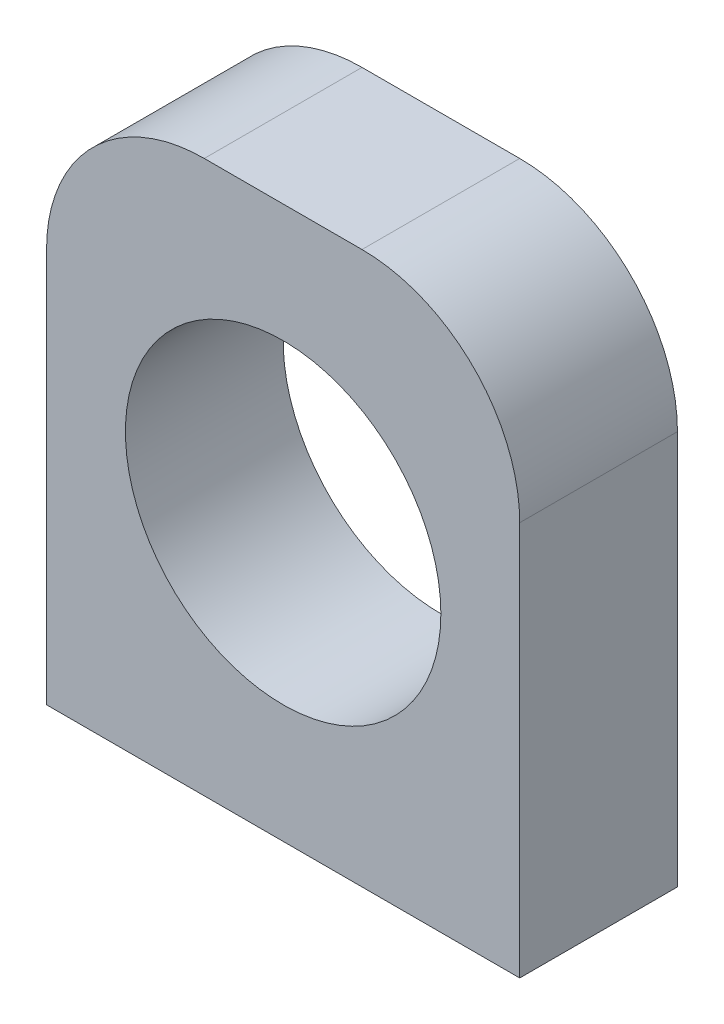
ISO-10303-21;
HEADER;
FILE_DESCRIPTION(('STEP AP214'),'2;1');
FILE_NAME('part.step','',(''),(''),'','','');
FILE_SCHEMA(('AUTOMOTIVE_DESIGN { 1 0 10303 214 1 1 1 1 }'));
ENDSEC;
DATA;
#1=APPLICATION_CONTEXT('core data for automotive mechanical design processes');
#2=APPLICATION_PROTOCOL_DEFINITION('international standard','automotive_design',2000,#1);
#3=PRODUCT_CONTEXT('',#1,'mechanical');
#4=PRODUCT('Part','Part','',(#3));
#5=PRODUCT_RELATED_PRODUCT_CATEGORY('part','',(#4));
#6=PRODUCT_DEFINITION_FORMATION('','',#4);
#7=PRODUCT_DEFINITION_CONTEXT('part definition',#1,'design');
#8=PRODUCT_DEFINITION('design','',#6,#7);
#9=PRODUCT_DEFINITION_SHAPE('','',#8);
#10=(LENGTH_UNIT() NAMED_UNIT(*) SI_UNIT(.MILLI.,.METRE.));
#11=(NAMED_UNIT(*) PLANE_ANGLE_UNIT() SI_UNIT($,.RADIAN.));
#12=(NAMED_UNIT(*) SI_UNIT($,.STERADIAN.) SOLID_ANGLE_UNIT());
#13=UNCERTAINTY_MEASURE_WITH_UNIT(LENGTH_MEASURE(1.E-05),#10,'distance_accuracy_value','');
#14=(GEOMETRIC_REPRESENTATION_CONTEXT(3) GLOBAL_UNCERTAINTY_ASSIGNED_CONTEXT((#13)) GLOBAL_UNIT_ASSIGNED_CONTEXT((#10,
#11,#12)) REPRESENTATION_CONTEXT('',''));
#15=CARTESIAN_POINT('',(0.,0.,0.));
#16=DIRECTION('',(0.,0.,1.));
#17=DIRECTION('',(1.,0.,0.));
#18=AXIS2_PLACEMENT_3D('',#15,#16,#17);
#19=CARTESIAN_POINT('',(12.7,19.05,12.7));
#20=DIRECTION('',(0.,0.,1.));
#21=DIRECTION('',(1.,0.,0.));
#22=AXIS2_PLACEMENT_3D('',#19,#20,#21);
#23=PLANE('',#22);
#24=DIRECTION('',(0.,1.,0.));
#25=VECTOR('',#24,1.);
#26=CARTESIAN_POINT('',(38.1,-44.45,12.7));
#27=LINE('',#26,#25);
#28=CARTESIAN_POINT('',(38.1,-44.45,12.7));
#29=VERTEX_POINT('',#28);
#30=CARTESIAN_POINT('',(38.1,19.05,12.7));
#31=VERTEX_POINT('',#30);
#32=EDGE_CURVE('E139',#29,#31,#27,.T.);
#33=ORIENTED_EDGE('',*,*,#32,.T.);
#34=CARTESIAN_POINT('',(12.7,19.05,12.7));
#35=DIRECTION('',(0.,0.,1.));
#36=DIRECTION('',(1.,0.,0.));
#37=AXIS2_PLACEMENT_3D('',#34,#35,#36);
#38=CIRCLE('',#37,25.4);
#39=CARTESIAN_POINT('',(12.7,44.45,12.7));
#40=VERTEX_POINT('',#39);
#41=EDGE_CURVE('E95',#31,#40,#38,.T.);
#42=ORIENTED_EDGE('',*,*,#41,.T.);
#43=DIRECTION('',(-1.,0.,0.));
#44=VECTOR('',#43,1.);
#45=CARTESIAN_POINT('',(12.7,44.45,12.7));
#46=LINE('',#45,#44);
#47=CARTESIAN_POINT('',(-12.7,44.45,12.7));
#48=VERTEX_POINT('',#47);
#49=EDGE_CURVE('E110',#40,#48,#46,.T.);
#50=ORIENTED_EDGE('',*,*,#49,.T.);
#51=CARTESIAN_POINT('',(-12.7,19.05,12.7));
#52=DIRECTION('',(0.,0.,1.));
#53=DIRECTION('',(1.,0.,0.));
#54=AXIS2_PLACEMENT_3D('',#51,#52,#53);
#55=CIRCLE('',#54,25.4);
#56=CARTESIAN_POINT('',(-38.1,19.05,12.7));
#57=VERTEX_POINT('',#56);
#58=EDGE_CURVE('E104',#48,#57,#55,.T.);
#59=ORIENTED_EDGE('',*,*,#58,.T.);
#60=DIRECTION('',(0.,-1.,0.));
#61=VECTOR('',#60,1.);
#62=CARTESIAN_POINT('',(-38.1,-44.45,12.7));
#63=LINE('',#62,#61);
#64=CARTESIAN_POINT('',(-38.1,-44.45,12.7));
#65=VERTEX_POINT('',#64);
#66=EDGE_CURVE('E108',#57,#65,#63,.T.);
#67=ORIENTED_EDGE('',*,*,#66,.T.);
#68=DIRECTION('',(1.,0.,0.));
#69=VECTOR('',#68,1.);
#70=CARTESIAN_POINT('',(38.1,-44.45,12.7));
#71=LINE('',#70,#69);
#72=EDGE_CURVE('E57',#65,#29,#71,.T.);
#73=ORIENTED_EDGE('',*,*,#72,.T.);
#74=EDGE_LOOP('',(#33,#42,#50,#59,#67,#73));
#75=FACE_BOUND('',#74,.T.);
#76=CARTESIAN_POINT('',(0.,0.,12.7));
#77=DIRECTION('',(0.,0.,1.));
#78=DIRECTION('',(1.,0.,0.));
#79=AXIS2_PLACEMENT_3D('',#76,#77,#78);
#80=CIRCLE('',#79,25.4);
#81=CARTESIAN_POINT('',(25.4,0.,12.7));
#82=VERTEX_POINT('',#81);
#83=EDGE_CURVE('E132',#82,#82,#80,.T.);
#84=ORIENTED_EDGE('',*,*,#83,.F.);
#85=EDGE_LOOP('',(#84));
#86=FACE_BOUND('',#85,.T.);
#87=ADVANCED_FACE('F40',(#75,#86),#23,.T.);
#88=CARTESIAN_POINT('',(12.7,19.05,-12.7));
#89=DIRECTION('',(0.,0.,1.));
#90=DIRECTION('',(1.,0.,0.));
#91=AXIS2_PLACEMENT_3D('',#88,#89,#90);
#92=PLANE('',#91);
#93=DIRECTION('',(0.,1.,0.));
#94=VECTOR('',#93,1.);
#95=CARTESIAN_POINT('',(38.1,-44.45,-12.7));
#96=LINE('',#95,#94);
#97=CARTESIAN_POINT('',(38.1,-44.45,-12.7));
#98=VERTEX_POINT('',#97);
#99=CARTESIAN_POINT('',(38.1,19.05,-12.7));
#100=VERTEX_POINT('',#99);
#101=EDGE_CURVE('E128',#98,#100,#96,.T.);
#102=ORIENTED_EDGE('',*,*,#101,.F.);
#103=DIRECTION('',(1.,0.,0.));
#104=VECTOR('',#103,1.);
#105=CARTESIAN_POINT('',(38.1,-44.45,-12.7));
#106=LINE('',#105,#104);
#107=CARTESIAN_POINT('',(-38.1,-44.45,-12.7));
#108=VERTEX_POINT('',#107);
#109=EDGE_CURVE('E87',#108,#98,#106,.T.);
#110=ORIENTED_EDGE('',*,*,#109,.F.);
#111=DIRECTION('',(0.,-1.,0.));
#112=VECTOR('',#111,1.);
#113=CARTESIAN_POINT('',(-38.1,-44.45,-12.7));
#114=LINE('',#113,#112);
#115=CARTESIAN_POINT('',(-38.1,19.05,-12.7));
#116=VERTEX_POINT('',#115);
#117=EDGE_CURVE('E81',#116,#108,#114,.T.);
#118=ORIENTED_EDGE('',*,*,#117,.F.);
#119=CARTESIAN_POINT('',(-12.7,19.05,-12.7));
#120=DIRECTION('',(0.,0.,1.));
#121=DIRECTION('',(1.,0.,0.));
#122=AXIS2_PLACEMENT_3D('',#119,#120,#121);
#123=CIRCLE('',#122,25.4);
#124=CARTESIAN_POINT('',(-12.7,44.45,-12.7));
#125=VERTEX_POINT('',#124);
#126=EDGE_CURVE('E118',#125,#116,#123,.T.);
#127=ORIENTED_EDGE('',*,*,#126,.F.);
#128=DIRECTION('',(-1.,0.,0.));
#129=VECTOR('',#128,1.);
#130=CARTESIAN_POINT('',(12.7,44.45,-12.7));
#131=LINE('',#130,#129);
#132=CARTESIAN_POINT('',(12.7,44.45,-12.7));
#133=VERTEX_POINT('',#132);
#134=EDGE_CURVE('E134',#133,#125,#131,.T.);
#135=ORIENTED_EDGE('',*,*,#134,.F.);
#136=CARTESIAN_POINT('',(12.7,19.05,-12.7));
#137=DIRECTION('',(0.,0.,1.));
#138=DIRECTION('',(1.,0.,0.));
#139=AXIS2_PLACEMENT_3D('',#136,#137,#138);
#140=CIRCLE('',#139,25.4);
#141=EDGE_CURVE('E131',#100,#133,#140,.T.);
#142=ORIENTED_EDGE('',*,*,#141,.F.);
#143=EDGE_LOOP('',(#102,#110,#118,#127,#135,#142));
#144=FACE_BOUND('',#143,.T.);
#145=CARTESIAN_POINT('',(0.,0.,-12.7));
#146=DIRECTION('',(0.,0.,1.));
#147=DIRECTION('',(1.,0.,0.));
#148=AXIS2_PLACEMENT_3D('',#145,#146,#147);
#149=CIRCLE('',#148,25.4);
#150=CARTESIAN_POINT('',(25.4,0.,-12.7));
#151=VERTEX_POINT('',#150);
#152=EDGE_CURVE('E234',#151,#151,#149,.T.);
#153=ORIENTED_EDGE('',*,*,#152,.T.);
#154=EDGE_LOOP('',(#153));
#155=FACE_BOUND('',#154,.T.);
#156=ADVANCED_FACE('F148',(#144,#155),#92,.F.);
#157=CARTESIAN_POINT('',(38.1,-44.45,12.7));
#158=DIRECTION('',(-1.,0.,0.));
#159=DIRECTION('',(0.,0.,1.));
#160=AXIS2_PLACEMENT_3D('',#157,#158,#159);
#161=PLANE('',#160);
#162=ORIENTED_EDGE('',*,*,#101,.T.);
#163=DIRECTION('',(0.,0.,-1.));
#164=VECTOR('',#163,1.);
#165=CARTESIAN_POINT('',(38.1,19.05,12.7));
#166=LINE('',#165,#164);
#167=EDGE_CURVE('E11',#31,#100,#166,.T.);
#168=ORIENTED_EDGE('',*,*,#167,.F.);
#169=ORIENTED_EDGE('',*,*,#32,.F.);
#170=DIRECTION('',(0.,0.,-1.));
#171=VECTOR('',#170,1.);
#172=CARTESIAN_POINT('',(38.1,-44.45,12.7));
#173=LINE('',#172,#171);
#174=EDGE_CURVE('E124',#29,#98,#173,.T.);
#175=ORIENTED_EDGE('',*,*,#174,.T.);
#176=EDGE_LOOP('',(#162,#168,#169,#175));
#177=FACE_BOUND('',#176,.T.);
#178=ADVANCED_FACE('F42',(#177),#161,.F.);
#179=CARTESIAN_POINT('',(12.7,19.05,12.7));
#180=DIRECTION('',(0.,0.,-1.));
#181=DIRECTION('',(-1.,0.,0.));
#182=AXIS2_PLACEMENT_3D('',#179,#180,#181);
#183=CYLINDRICAL_SURFACE('',#182,25.4);
#184=ORIENTED_EDGE('',*,*,#141,.T.);
#185=DIRECTION('',(0.,0.,-1.));
#186=VECTOR('',#185,1.);
#187=CARTESIAN_POINT('',(12.7,44.45,12.7));
#188=LINE('',#187,#186);
#189=EDGE_CURVE('E49',#40,#133,#188,.T.);
#190=ORIENTED_EDGE('',*,*,#189,.F.);
#191=ORIENTED_EDGE('',*,*,#41,.F.);
#192=ORIENTED_EDGE('',*,*,#167,.T.);
#193=EDGE_LOOP('',(#184,#190,#191,#192));
#194=FACE_BOUND('',#193,.T.);
#195=ADVANCED_FACE('F320',(#194),#183,.T.);
#196=CARTESIAN_POINT('',(12.7,44.45,12.7));
#197=DIRECTION('',(0.,-1.,0.));
#198=DIRECTION('',(0.,0.,-1.));
#199=AXIS2_PLACEMENT_3D('',#196,#197,#198);
#200=PLANE('',#199);
#201=ORIENTED_EDGE('',*,*,#134,.T.);
#202=DIRECTION('',(0.,0.,-1.));
#203=VECTOR('',#202,1.);
#204=CARTESIAN_POINT('',(-12.7,44.45,12.7));
#205=LINE('',#204,#203);
#206=EDGE_CURVE('E119',#48,#125,#205,.T.);
#207=ORIENTED_EDGE('',*,*,#206,.F.);
#208=ORIENTED_EDGE('',*,*,#49,.F.);
#209=ORIENTED_EDGE('',*,*,#189,.T.);
#210=EDGE_LOOP('',(#201,#207,#208,#209));
#211=FACE_BOUND('',#210,.T.);
#212=ADVANCED_FACE('F145',(#211),#200,.F.);
#213=CARTESIAN_POINT('',(-12.7,19.05,12.7));
#214=DIRECTION('',(0.,0.,-1.));
#215=DIRECTION('',(-1.,0.,0.));
#216=AXIS2_PLACEMENT_3D('',#213,#214,#215);
#217=CYLINDRICAL_SURFACE('',#216,25.4);
#218=ORIENTED_EDGE('',*,*,#126,.T.);
#219=DIRECTION('',(0.,0.,-1.));
#220=VECTOR('',#219,1.);
#221=CARTESIAN_POINT('',(-38.1,19.05,12.7));
#222=LINE('',#221,#220);
#223=EDGE_CURVE('E115',#57,#116,#222,.T.);
#224=ORIENTED_EDGE('',*,*,#223,.F.);
#225=ORIENTED_EDGE('',*,*,#58,.F.);
#226=ORIENTED_EDGE('',*,*,#206,.T.);
#227=EDGE_LOOP('',(#218,#224,#225,#226));
#228=FACE_BOUND('',#227,.T.);
#229=ADVANCED_FACE('F116',(#228),#217,.T.);
#230=CARTESIAN_POINT('',(-38.1,-44.45,12.7));
#231=DIRECTION('',(1.,0.,0.));
#232=DIRECTION('',(0.,0.,-1.));
#233=AXIS2_PLACEMENT_3D('',#230,#231,#232);
#234=PLANE('',#233);
#235=ORIENTED_EDGE('',*,*,#117,.T.);
#236=DIRECTION('',(0.,0.,-1.));
#237=VECTOR('',#236,1.);
#238=CARTESIAN_POINT('',(-38.1,-44.45,12.7));
#239=LINE('',#238,#237);
#240=EDGE_CURVE('E120',#65,#108,#239,.T.);
#241=ORIENTED_EDGE('',*,*,#240,.F.);
#242=ORIENTED_EDGE('',*,*,#66,.F.);
#243=ORIENTED_EDGE('',*,*,#223,.T.);
#244=EDGE_LOOP('',(#235,#241,#242,#243));
#245=FACE_BOUND('',#244,.T.);
#246=ADVANCED_FACE('F122',(#245),#234,.F.);
#247=CARTESIAN_POINT('',(38.1,-44.45,12.7));
#248=DIRECTION('',(0.,1.,0.));
#249=DIRECTION('',(-1.,0.,0.));
#250=AXIS2_PLACEMENT_3D('',#247,#248,#249);
#251=PLANE('',#250);
#252=CARTESIAN_POINT('',(-19.05,-44.45,7.9375));
#253=DIRECTION('',(0.,-1.,0.));
#254=DIRECTION('',(0.,0.,-1.));
#255=AXIS2_PLACEMENT_3D('',#252,#253,#254);
#256=CIRCLE('',#255,2.0193);
#257=CARTESIAN_POINT('',(-19.05,-44.45,5.9182));
#258=VERTEX_POINT('',#257);
#259=EDGE_CURVE('E212',#258,#258,#256,.T.);
#260=ORIENTED_EDGE('',*,*,#259,.F.);
#261=EDGE_LOOP('',(#260));
#262=FACE_BOUND('',#261,.T.);
#263=CARTESIAN_POINT('',(19.05,-44.45,7.9375));
#264=DIRECTION('',(0.,-1.,0.));
#265=DIRECTION('',(0.,0.,-1.));
#266=AXIS2_PLACEMENT_3D('',#263,#264,#265);
#267=CIRCLE('',#266,2.0193);
#268=CARTESIAN_POINT('',(19.05,-44.45,5.9182));
#269=VERTEX_POINT('',#268);
#270=EDGE_CURVE('E214',#269,#269,#267,.T.);
#271=ORIENTED_EDGE('',*,*,#270,.F.);
#272=EDGE_LOOP('',(#271));
#273=FACE_BOUND('',#272,.T.);
#274=CARTESIAN_POINT('',(19.05,-44.45,-7.9375));
#275=DIRECTION('',(0.,-1.,0.));
#276=DIRECTION('',(0.,0.,-1.));
#277=AXIS2_PLACEMENT_3D('',#274,#275,#276);
#278=CIRCLE('',#277,2.0193);
#279=CARTESIAN_POINT('',(19.05,-44.45,-9.9568));
#280=VERTEX_POINT('',#279);
#281=EDGE_CURVE('E222',#280,#280,#278,.T.);
#282=ORIENTED_EDGE('',*,*,#281,.F.);
#283=EDGE_LOOP('',(#282));
#284=FACE_BOUND('',#283,.T.);
#285=CARTESIAN_POINT('',(-19.05,-44.45,-7.9375));
#286=DIRECTION('',(0.,-1.,0.));
#287=DIRECTION('',(0.,0.,-1.));
#288=AXIS2_PLACEMENT_3D('',#285,#286,#287);
#289=CIRCLE('',#288,2.0193);
#290=CARTESIAN_POINT('',(-19.05,-44.45,-9.9568));
#291=VERTEX_POINT('',#290);
#292=EDGE_CURVE('E228',#291,#291,#289,.T.);
#293=ORIENTED_EDGE('',*,*,#292,.F.);
#294=EDGE_LOOP('',(#293));
#295=FACE_BOUND('',#294,.T.);
#296=ORIENTED_EDGE('',*,*,#109,.T.);
#297=ORIENTED_EDGE('',*,*,#174,.F.);
#298=ORIENTED_EDGE('',*,*,#72,.F.);
#299=ORIENTED_EDGE('',*,*,#240,.T.);
#300=EDGE_LOOP('',(#296,#297,#298,#299));
#301=FACE_BOUND('',#300,.T.);
#302=ADVANCED_FACE('F153',(#262,#273,#284,#295,#301),#251,.F.);
#303=CARTESIAN_POINT('',(0.,0.,12.7));
#304=DIRECTION('',(0.,0.,-1.));
#305=DIRECTION('',(-1.,0.,0.));
#306=AXIS2_PLACEMENT_3D('',#303,#304,#305);
#307=CYLINDRICAL_SURFACE('',#306,25.4);
#308=ORIENTED_EDGE('',*,*,#83,.T.);
#309=EDGE_LOOP('',(#308));
#310=FACE_BOUND('',#309,.T.);
#311=ORIENTED_EDGE('',*,*,#152,.F.);
#312=EDGE_LOOP('',(#311));
#313=FACE_BOUND('',#312,.T.);
#314=ADVANCED_FACE('F155',(#310,#313),#307,.F.);
#315=CARTESIAN_POINT('',(-19.05,-32.42056,-7.9375));
#316=DIRECTION('',(0.,-1.,0.));
#317=DIRECTION('',(0.,0.,-1.));
#318=AXIS2_PLACEMENT_3D('',#315,#316,#317);
#319=CONICAL_SURFACE('',#318,2.0193,1.02974425867665);
#320=CARTESIAN_POINT('',(-19.05,-31.2072421519976,-7.9375));
#321=VERTEX_POINT('',#320);
#322=VERTEX_LOOP('',#321);
#323=FACE_BOUND('',#322,.T.);
#324=CARTESIAN_POINT('',(-19.05,-32.42056,-7.9375));
#325=DIRECTION('',(0.,-1.,0.));
#326=DIRECTION('',(0.,0.,-1.));
#327=AXIS2_PLACEMENT_3D('',#324,#325,#326);
#328=CIRCLE('',#327,2.0193);
#329=CARTESIAN_POINT('',(-19.05,-32.42056,-9.9568));
#330=VERTEX_POINT('',#329);
#331=EDGE_CURVE('E231',#330,#330,#328,.T.);
#332=ORIENTED_EDGE('',*,*,#331,.T.);
#333=EDGE_LOOP('',(#332));
#334=FACE_BOUND('',#333,.T.);
#335=ADVANCED_FACE('F162',(#323,#334),#319,.F.);
#336=CARTESIAN_POINT('',(-19.05,-44.45,-7.9375));
#337=DIRECTION('',(0.,-1.,0.));
#338=DIRECTION('',(0.,0.,-1.));
#339=AXIS2_PLACEMENT_3D('',#336,#337,#338);
#340=CYLINDRICAL_SURFACE('',#339,2.0193);
#341=ORIENTED_EDGE('',*,*,#331,.F.);
#342=EDGE_LOOP('',(#341));
#343=FACE_BOUND('',#342,.T.);
#344=ORIENTED_EDGE('',*,*,#292,.T.);
#345=EDGE_LOOP('',(#344));
#346=FACE_BOUND('',#345,.T.);
#347=ADVANCED_FACE('F177',(#343,#346),#340,.F.);
#348=CARTESIAN_POINT('',(19.05,-32.42056,-7.9375));
#349=DIRECTION('',(0.,-1.,0.));
#350=DIRECTION('',(0.,0.,-1.));
#351=AXIS2_PLACEMENT_3D('',#348,#349,#350);
#352=CONICAL_SURFACE('',#351,2.0193,1.02974425867665);
#353=CARTESIAN_POINT('',(19.05,-31.2072421519976,-7.9375));
#354=VERTEX_POINT('',#353);
#355=VERTEX_LOOP('',#354);
#356=FACE_BOUND('',#355,.T.);
#357=CARTESIAN_POINT('',(19.05,-32.42056,-7.9375));
#358=DIRECTION('',(0.,-1.,0.));
#359=DIRECTION('',(0.,0.,-1.));
#360=AXIS2_PLACEMENT_3D('',#357,#358,#359);
#361=CIRCLE('',#360,2.0193);
#362=CARTESIAN_POINT('',(19.05,-32.42056,-9.9568));
#363=VERTEX_POINT('',#362);
#364=EDGE_CURVE('E225',#363,#363,#361,.T.);
#365=ORIENTED_EDGE('',*,*,#364,.T.);
#366=EDGE_LOOP('',(#365));
#367=FACE_BOUND('',#366,.T.);
#368=ADVANCED_FACE('F181',(#356,#367),#352,.F.);
#369=CARTESIAN_POINT('',(19.05,-44.45,-7.9375));
#370=DIRECTION('',(0.,-1.,0.));
#371=DIRECTION('',(0.,0.,-1.));
#372=AXIS2_PLACEMENT_3D('',#369,#370,#371);
#373=CYLINDRICAL_SURFACE('',#372,2.0193);
#374=ORIENTED_EDGE('',*,*,#364,.F.);
#375=EDGE_LOOP('',(#374));
#376=FACE_BOUND('',#375,.T.);
#377=ORIENTED_EDGE('',*,*,#281,.T.);
#378=EDGE_LOOP('',(#377));
#379=FACE_BOUND('',#378,.T.);
#380=ADVANCED_FACE('F185',(#376,#379),#373,.F.);
#381=CARTESIAN_POINT('',(19.05,-32.42056,7.9375));
#382=DIRECTION('',(0.,-1.,0.));
#383=DIRECTION('',(0.,0.,-1.));
#384=AXIS2_PLACEMENT_3D('',#381,#382,#383);
#385=CONICAL_SURFACE('',#384,2.0193,1.02974425867665);
#386=CARTESIAN_POINT('',(19.05,-31.2072421519976,7.9375));
#387=VERTEX_POINT('',#386);
#388=VERTEX_LOOP('',#387);
#389=FACE_BOUND('',#388,.T.);
#390=CARTESIAN_POINT('',(19.05,-32.42056,7.9375));
#391=DIRECTION('',(0.,-1.,0.));
#392=DIRECTION('',(0.,0.,-1.));
#393=AXIS2_PLACEMENT_3D('',#390,#391,#392);
#394=CIRCLE('',#393,2.0193);
#395=CARTESIAN_POINT('',(19.05,-32.42056,5.9182));
#396=VERTEX_POINT('',#395);
#397=EDGE_CURVE('E219',#396,#396,#394,.T.);
#398=ORIENTED_EDGE('',*,*,#397,.T.);
#399=EDGE_LOOP('',(#398));
#400=FACE_BOUND('',#399,.T.);
#401=ADVANCED_FACE('F189',(#389,#400),#385,.F.);
#402=CARTESIAN_POINT('',(19.05,-44.45,7.9375));
#403=DIRECTION('',(0.,-1.,0.));
#404=DIRECTION('',(0.,0.,-1.));
#405=AXIS2_PLACEMENT_3D('',#402,#403,#404);
#406=CYLINDRICAL_SURFACE('',#405,2.0193);
#407=ORIENTED_EDGE('',*,*,#397,.F.);
#408=EDGE_LOOP('',(#407));
#409=FACE_BOUND('',#408,.T.);
#410=ORIENTED_EDGE('',*,*,#270,.T.);
#411=EDGE_LOOP('',(#410));
#412=FACE_BOUND('',#411,.T.);
#413=ADVANCED_FACE('F193',(#409,#412),#406,.F.);
#414=CARTESIAN_POINT('',(-19.05,-32.42056,7.9375));
#415=DIRECTION('',(0.,-1.,0.));
#416=DIRECTION('',(0.,0.,-1.));
#417=AXIS2_PLACEMENT_3D('',#414,#415,#416);
#418=CONICAL_SURFACE('',#417,2.0193,1.02974425867665);
#419=CARTESIAN_POINT('',(-19.05,-31.2072421519976,7.9375));
#420=VERTEX_POINT('',#419);
#421=VERTEX_LOOP('',#420);
#422=FACE_BOUND('',#421,.T.);
#423=CARTESIAN_POINT('',(-19.05,-32.42056,7.9375));
#424=DIRECTION('',(0.,-1.,0.));
#425=DIRECTION('',(0.,0.,-1.));
#426=AXIS2_PLACEMENT_3D('',#423,#424,#425);
#427=CIRCLE('',#426,2.0193);
#428=CARTESIAN_POINT('',(-19.05,-32.42056,5.9182));
#429=VERTEX_POINT('',#428);
#430=EDGE_CURVE('E210',#429,#429,#427,.T.);
#431=ORIENTED_EDGE('',*,*,#430,.T.);
#432=EDGE_LOOP('',(#431));
#433=FACE_BOUND('',#432,.T.);
#434=ADVANCED_FACE('F197',(#422,#433),#418,.F.);
#435=CARTESIAN_POINT('',(-19.05,-44.45,7.9375));
#436=DIRECTION('',(0.,-1.,0.));
#437=DIRECTION('',(0.,0.,-1.));
#438=AXIS2_PLACEMENT_3D('',#435,#436,#437);
#439=CYLINDRICAL_SURFACE('',#438,2.0193);
#440=ORIENTED_EDGE('',*,*,#430,.F.);
#441=EDGE_LOOP('',(#440));
#442=FACE_BOUND('',#441,.T.);
#443=ORIENTED_EDGE('',*,*,#259,.T.);
#444=EDGE_LOOP('',(#443));
#445=FACE_BOUND('',#444,.T.);
#446=ADVANCED_FACE('F201',(#442,#445),#439,.F.);
#447=CLOSED_SHELL('',(#87,#156,#178,#195,#212,#229,#246,#302,#314,#335,#347,#368,#380,#401,#413,
#434,#446));
#448=MANIFOLD_SOLID_BREP('B2',#447);
#449=ADVANCED_BREP_SHAPE_REPRESENTATION('',(#18,#448),#14);
#450=SHAPE_DEFINITION_REPRESENTATION(#9,#449);
ENDSEC;
END-ISO-10303-21;
